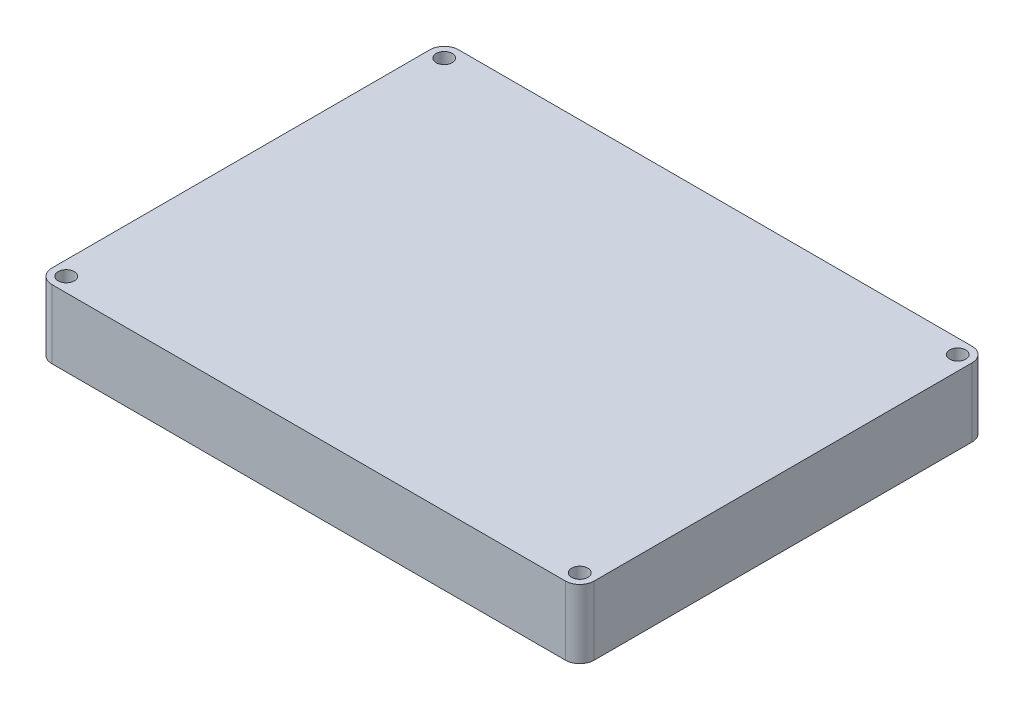
ISO-10303-21;
HEADER;
FILE_DESCRIPTION(('STEP AP214'),'2;1');
FILE_NAME('part.step','',(''),(''),'','','');
FILE_SCHEMA(('AUTOMOTIVE_DESIGN { 1 0 10303 214 1 1 1 1 }'));
ENDSEC;
DATA;
#1=APPLICATION_CONTEXT('core data for automotive mechanical design processes');
#2=APPLICATION_PROTOCOL_DEFINITION('international standard','automotive_design',2000,#1);
#3=PRODUCT_CONTEXT('',#1,'mechanical');
#4=PRODUCT('Part','Part','',(#3));
#5=PRODUCT_RELATED_PRODUCT_CATEGORY('part','',(#4));
#6=PRODUCT_DEFINITION_FORMATION('','',#4);
#7=PRODUCT_DEFINITION_CONTEXT('part definition',#1,'design');
#8=PRODUCT_DEFINITION('design','',#6,#7);
#9=PRODUCT_DEFINITION_SHAPE('','',#8);
#10=(LENGTH_UNIT() NAMED_UNIT(*) SI_UNIT(.MILLI.,.METRE.));
#11=(NAMED_UNIT(*) PLANE_ANGLE_UNIT() SI_UNIT($,.RADIAN.));
#12=(NAMED_UNIT(*) SI_UNIT($,.STERADIAN.) SOLID_ANGLE_UNIT());
#13=UNCERTAINTY_MEASURE_WITH_UNIT(LENGTH_MEASURE(1.E-05),#10,'distance_accuracy_value','');
#14=(GEOMETRIC_REPRESENTATION_CONTEXT(3) GLOBAL_UNCERTAINTY_ASSIGNED_CONTEXT((#13)) GLOBAL_UNIT_ASSIGNED_CONTEXT((#10,
#11,#12)) REPRESENTATION_CONTEXT('',''));
#15=CARTESIAN_POINT('',(0.,0.,0.));
#16=DIRECTION('',(0.,0.,1.));
#17=DIRECTION('',(1.,0.,0.));
#18=AXIS2_PLACEMENT_3D('',#15,#16,#17);
#19=CARTESIAN_POINT('',(80.8445341713162,214.381102149178,252.663824419124));
#20=DIRECTION('',(0.,1.,0.));
#21=DIRECTION('',(1.,0.,0.));
#22=AXIS2_PLACEMENT_3D('',#19,#20,#21);
#23=PLANE('',#22);
#24=CARTESIAN_POINT('',(43.6819406533246,214.381102149178,330.90453928392));
#25=DIRECTION('',(0.,1.,0.));
#26=DIRECTION('',(0.,0.,1.));
#27=AXIS2_PLACEMENT_3D('',#24,#25,#26);
#28=CIRCLE('',#27,1.786001);
#29=CARTESIAN_POINT('',(43.6819406533246,214.381102149178,332.69054028392));
#30=VERTEX_POINT('',#29);
#31=EDGE_CURVE('E189',#30,#30,#28,.T.);
#32=ORIENTED_EDGE('',*,*,#31,.F.);
#33=EDGE_LOOP('',(#32));
#34=FACE_BOUND('',#33,.T.);
#35=CARTESIAN_POINT('',(43.6819406533246,214.381102149178,247.25453928392));
#36=DIRECTION('',(0.,1.,0.));
#37=DIRECTION('',(0.,0.,1.));
#38=AXIS2_PLACEMENT_3D('',#35,#36,#37);
#39=CIRCLE('',#38,1.786001);
#40=CARTESIAN_POINT('',(43.6819406533246,214.381102149178,249.04054028392));
#41=VERTEX_POINT('',#40);
#42=EDGE_CURVE('E183',#41,#41,#39,.T.);
#43=ORIENTED_EDGE('',*,*,#42,.F.);
#44=EDGE_LOOP('',(#43));
#45=FACE_BOUND('',#44,.T.);
#46=CARTESIAN_POINT('',(157.331940653325,214.381102149178,247.25453928392));
#47=DIRECTION('',(0.,1.,0.));
#48=DIRECTION('',(0.,0.,1.));
#49=AXIS2_PLACEMENT_3D('',#46,#47,#48);
#50=CIRCLE('',#49,1.78600100000001);
#51=CARTESIAN_POINT('',(157.331940653325,214.381102149178,249.04054028392));
#52=VERTEX_POINT('',#51);
#53=EDGE_CURVE('E177',#52,#52,#50,.T.);
#54=ORIENTED_EDGE('',*,*,#53,.F.);
#55=EDGE_LOOP('',(#54));
#56=FACE_BOUND('',#55,.T.);
#57=CARTESIAN_POINT('',(157.331940653325,214.381102149178,330.90453928392));
#58=DIRECTION('',(0.,1.,0.));
#59=DIRECTION('',(0.,0.,1.));
#60=AXIS2_PLACEMENT_3D('',#57,#58,#59);
#61=CIRCLE('',#60,1.78600100000001);
#62=CARTESIAN_POINT('',(157.331940653325,214.381102149178,332.69054028392));
#63=VERTEX_POINT('',#62);
#64=EDGE_CURVE('E171',#63,#63,#61,.T.);
#65=ORIENTED_EDGE('',*,*,#64,.F.);
#66=EDGE_LOOP('',(#65));
#67=FACE_BOUND('',#66,.T.);
#68=DIRECTION('',(-1.,0.,0.));
#69=VECTOR('',#68,1.);
#70=CARTESIAN_POINT('',(82.2269406532946,214.381102149178,334.07953928392));
#71=LINE('',#70,#69);
#72=CARTESIAN_POINT('',(157.331940653325,214.381102149178,334.07953928392));
#73=VERTEX_POINT('',#72);
#74=CARTESIAN_POINT('',(43.6819406533246,214.381102149178,334.07953928392));
#75=VERTEX_POINT('',#74);
#76=EDGE_CURVE('E40',#73,#75,#71,.T.);
#77=ORIENTED_EDGE('',*,*,#76,.F.);
#78=CARTESIAN_POINT('',(157.331940653325,214.381102149178,330.90453928392));
#79=DIRECTION('',(0.,1.,0.));
#80=DIRECTION('',(0.,0.,1.));
#81=AXIS2_PLACEMENT_3D('',#78,#79,#80);
#82=CIRCLE('',#81,3.175);
#83=CARTESIAN_POINT('',(160.506940653325,214.381102149178,330.90453928392));
#84=VERTEX_POINT('',#83);
#85=EDGE_CURVE('E127',#84,#73,#82,.F.);
#86=ORIENTED_EDGE('',*,*,#85,.F.);
#87=DIRECTION('',(0.,0.,1.));
#88=VECTOR('',#87,1.);
#89=CARTESIAN_POINT('',(160.506940653325,214.381102149178,301.30953928392));
#90=LINE('',#89,#88);
#91=CARTESIAN_POINT('',(160.506940653325,214.381102149178,247.25453928392));
#92=VERTEX_POINT('',#91);
#93=EDGE_CURVE('E131',#92,#84,#90,.T.);
#94=ORIENTED_EDGE('',*,*,#93,.F.);
#95=CARTESIAN_POINT('',(157.331940653325,214.381102149178,247.25453928392));
#96=DIRECTION('',(0.,1.,0.));
#97=DIRECTION('',(0.,0.,1.));
#98=AXIS2_PLACEMENT_3D('',#95,#96,#97);
#99=CIRCLE('',#98,3.17500000000001);
#100=CARTESIAN_POINT('',(157.331940653325,214.381102149178,244.07953928392));
#101=VERTEX_POINT('',#100);
#102=EDGE_CURVE('E135',#101,#92,#99,.F.);
#103=ORIENTED_EDGE('',*,*,#102,.F.);
#104=DIRECTION('',(1.,0.,0.));
#105=VECTOR('',#104,1.);
#106=CARTESIAN_POINT('',(82.2269406532946,214.381102149178,244.07953928392));
#107=LINE('',#106,#105);
#108=CARTESIAN_POINT('',(43.6819406533246,214.381102149178,244.07953928392));
#109=VERTEX_POINT('',#108);
#110=EDGE_CURVE('E139',#109,#101,#107,.T.);
#111=ORIENTED_EDGE('',*,*,#110,.F.);
#112=CARTESIAN_POINT('',(43.6819406533246,214.381102149178,247.25453928392));
#113=DIRECTION('',(0.,1.,0.));
#114=DIRECTION('',(0.,0.,1.));
#115=AXIS2_PLACEMENT_3D('',#112,#113,#114);
#116=CIRCLE('',#115,3.175);
#117=CARTESIAN_POINT('',(40.5069406533246,214.381102149178,247.25453928392));
#118=VERTEX_POINT('',#117);
#119=EDGE_CURVE('E75',#118,#109,#116,.F.);
#120=ORIENTED_EDGE('',*,*,#119,.F.);
#121=DIRECTION('',(0.,0.,-1.));
#122=VECTOR('',#121,1.);
#123=CARTESIAN_POINT('',(40.5069406533246,214.381102149178,301.30953928392));
#124=LINE('',#123,#122);
#125=CARTESIAN_POINT('',(40.5069406533246,214.381102149178,330.90453928392));
#126=VERTEX_POINT('',#125);
#127=EDGE_CURVE('E80',#126,#118,#124,.T.);
#128=ORIENTED_EDGE('',*,*,#127,.F.);
#129=CARTESIAN_POINT('',(43.6819406533246,214.381102149178,330.90453928392));
#130=DIRECTION('',(0.,1.,0.));
#131=DIRECTION('',(0.,0.,1.));
#132=AXIS2_PLACEMENT_3D('',#129,#130,#131);
#133=CIRCLE('',#132,3.17499999999999);
#134=EDGE_CURVE('E107',#75,#126,#133,.F.);
#135=ORIENTED_EDGE('',*,*,#134,.F.);
#136=EDGE_LOOP('',(#77,#86,#94,#103,#111,#120,#128,#135));
#137=FACE_BOUND('',#136,.T.);
#138=ADVANCED_FACE('F32',(#34,#45,#56,#67,#137),#23,.T.);
#139=CARTESIAN_POINT('',(43.6819406533246,199.201102149175,330.90453928392));
#140=DIRECTION('',(0.,-1.,0.));
#141=DIRECTION('',(0.,0.,-1.));
#142=AXIS2_PLACEMENT_3D('',#139,#140,#141);
#143=PLANE('',#142);
#144=CARTESIAN_POINT('',(43.6819406533246,199.201102149175,330.90453928392));
#145=DIRECTION('',(0.,1.,0.));
#146=DIRECTION('',(0.,0.,1.));
#147=AXIS2_PLACEMENT_3D('',#144,#145,#146);
#148=CIRCLE('',#147,1.786001);
#149=CARTESIAN_POINT('',(43.6819406533246,199.201102149175,332.69054028392));
#150=VERTEX_POINT('',#149);
#151=EDGE_CURVE('E186',#150,#150,#148,.T.);
#152=ORIENTED_EDGE('',*,*,#151,.T.);
#153=EDGE_LOOP('',(#152));
#154=FACE_BOUND('',#153,.T.);
#155=CARTESIAN_POINT('',(43.6819406533246,199.201102149175,247.25453928392));
#156=DIRECTION('',(0.,1.,0.));
#157=DIRECTION('',(0.,0.,1.));
#158=AXIS2_PLACEMENT_3D('',#155,#156,#157);
#159=CIRCLE('',#158,1.786001);
#160=CARTESIAN_POINT('',(43.6819406533246,199.201102149175,249.04054028392));
#161=VERTEX_POINT('',#160);
#162=EDGE_CURVE('E180',#161,#161,#159,.T.);
#163=ORIENTED_EDGE('',*,*,#162,.T.);
#164=EDGE_LOOP('',(#163));
#165=FACE_BOUND('',#164,.T.);
#166=CARTESIAN_POINT('',(157.331940653325,199.201102149175,247.25453928392));
#167=DIRECTION('',(0.,1.,0.));
#168=DIRECTION('',(0.,0.,1.));
#169=AXIS2_PLACEMENT_3D('',#166,#167,#168);
#170=CIRCLE('',#169,1.78600100000001);
#171=CARTESIAN_POINT('',(157.331940653325,199.201102149175,249.04054028392));
#172=VERTEX_POINT('',#171);
#173=EDGE_CURVE('E174',#172,#172,#170,.T.);
#174=ORIENTED_EDGE('',*,*,#173,.T.);
#175=EDGE_LOOP('',(#174));
#176=FACE_BOUND('',#175,.T.);
#177=CARTESIAN_POINT('',(157.331940653325,199.201102149175,330.90453928392));
#178=DIRECTION('',(0.,1.,0.));
#179=DIRECTION('',(0.,0.,1.));
#180=AXIS2_PLACEMENT_3D('',#177,#178,#179);
#181=CIRCLE('',#180,1.78600100000001);
#182=CARTESIAN_POINT('',(157.331940653325,199.201102149175,332.69054028392));
#183=VERTEX_POINT('',#182);
#184=EDGE_CURVE('E119',#183,#183,#181,.T.);
#185=ORIENTED_EDGE('',*,*,#184,.T.);
#186=EDGE_LOOP('',(#185));
#187=FACE_BOUND('',#186,.T.);
#188=DIRECTION('',(-1.,0.,0.));
#189=VECTOR('',#188,1.);
#190=CARTESIAN_POINT('',(82.2269406532946,199.201102149175,334.07953928392));
#191=LINE('',#190,#189);
#192=CARTESIAN_POINT('',(157.331940653325,199.201102149175,334.07953928392));
#193=VERTEX_POINT('',#192);
#194=CARTESIAN_POINT('',(43.6819406533246,199.201102149175,334.07953928392));
#195=VERTEX_POINT('',#194);
#196=EDGE_CURVE('E117',#193,#195,#191,.T.);
#197=ORIENTED_EDGE('',*,*,#196,.T.);
#198=CARTESIAN_POINT('',(43.6819406533246,199.201102149175,330.90453928392));
#199=DIRECTION('',(0.,-1.,0.));
#200=DIRECTION('',(0.,0.,-1.));
#201=AXIS2_PLACEMENT_3D('',#198,#199,#200);
#202=CIRCLE('',#201,3.17499999999999);
#203=CARTESIAN_POINT('',(40.5069406533246,199.201102149175,330.90453928392));
#204=VERTEX_POINT('',#203);
#205=EDGE_CURVE('E105',#195,#204,#202,.T.);
#206=ORIENTED_EDGE('',*,*,#205,.T.);
#207=DIRECTION('',(0.,0.,-1.));
#208=VECTOR('',#207,1.);
#209=CARTESIAN_POINT('',(40.5069406533246,199.201102149175,301.30953928392));
#210=LINE('',#209,#208);
#211=CARTESIAN_POINT('',(40.5069406533246,199.201102149175,247.25453928392));
#212=VERTEX_POINT('',#211);
#213=EDGE_CURVE('E109',#204,#212,#210,.T.);
#214=ORIENTED_EDGE('',*,*,#213,.T.);
#215=CARTESIAN_POINT('',(43.6819406533246,199.201102149175,247.25453928392));
#216=DIRECTION('',(0.,-1.,0.));
#217=DIRECTION('',(0.,0.,-1.));
#218=AXIS2_PLACEMENT_3D('',#215,#216,#217);
#219=CIRCLE('',#218,3.175);
#220=CARTESIAN_POINT('',(43.6819406533246,199.201102149175,244.07953928392));
#221=VERTEX_POINT('',#220);
#222=EDGE_CURVE('E113',#212,#221,#219,.T.);
#223=ORIENTED_EDGE('',*,*,#222,.T.);
#224=DIRECTION('',(1.,0.,0.));
#225=VECTOR('',#224,1.);
#226=CARTESIAN_POINT('',(82.2269406532946,199.201102149175,244.07953928392));
#227=LINE('',#226,#225);
#228=CARTESIAN_POINT('',(157.331940653325,199.201102149175,244.07953928392));
#229=VERTEX_POINT('',#228);
#230=EDGE_CURVE('E156',#221,#229,#227,.T.);
#231=ORIENTED_EDGE('',*,*,#230,.T.);
#232=CARTESIAN_POINT('',(157.331940653325,199.201102149175,247.25453928392));
#233=DIRECTION('',(0.,-1.,0.));
#234=DIRECTION('',(0.,0.,-1.));
#235=AXIS2_PLACEMENT_3D('',#232,#233,#234);
#236=CIRCLE('',#235,3.17500000000001);
#237=CARTESIAN_POINT('',(160.506940653325,199.201102149175,247.25453928392));
#238=VERTEX_POINT('',#237);
#239=EDGE_CURVE('E161',#229,#238,#236,.T.);
#240=ORIENTED_EDGE('',*,*,#239,.T.);
#241=DIRECTION('',(0.,0.,1.));
#242=VECTOR('',#241,1.);
#243=CARTESIAN_POINT('',(160.506940653325,199.201102149175,301.30953928392));
#244=LINE('',#243,#242);
#245=CARTESIAN_POINT('',(160.506940653325,199.201102149175,330.90453928392));
#246=VERTEX_POINT('',#245);
#247=EDGE_CURVE('E165',#238,#246,#244,.T.);
#248=ORIENTED_EDGE('',*,*,#247,.T.);
#249=CARTESIAN_POINT('',(157.331940653325,199.201102149175,330.90453928392));
#250=DIRECTION('',(0.,-1.,0.));
#251=DIRECTION('',(0.,0.,-1.));
#252=AXIS2_PLACEMENT_3D('',#249,#250,#251);
#253=CIRCLE('',#252,3.175);
#254=EDGE_CURVE('E124',#246,#193,#253,.T.);
#255=ORIENTED_EDGE('',*,*,#254,.T.);
#256=EDGE_LOOP('',(#197,#206,#214,#223,#231,#240,#248,#255));
#257=FACE_BOUND('',#256,.T.);
#258=ADVANCED_FACE('F115',(#154,#165,#176,#187,#257),#143,.T.);
#259=CARTESIAN_POINT('',(43.6819406533246,364.381102149178,330.90453928392));
#260=DIRECTION('',(0.,-1.,0.));
#261=DIRECTION('',(0.,0.,-1.));
#262=AXIS2_PLACEMENT_3D('',#259,#260,#261);
#263=CYLINDRICAL_SURFACE('',#262,3.17499999999999);
#264=DIRECTION('',(0.,-1.,0.));
#265=VECTOR('',#264,1.);
#266=CARTESIAN_POINT('',(43.6819406533246,364.381102149178,334.07953928392));
#267=LINE('',#266,#265);
#268=EDGE_CURVE('E11',#75,#195,#267,.T.);
#269=ORIENTED_EDGE('',*,*,#268,.F.);
#270=ORIENTED_EDGE('',*,*,#134,.T.);
#271=DIRECTION('',(0.,-1.,0.));
#272=VECTOR('',#271,1.);
#273=CARTESIAN_POINT('',(40.5069406533246,364.381102149178,330.90453928392));
#274=LINE('',#273,#272);
#275=EDGE_CURVE('E102',#126,#204,#274,.T.);
#276=ORIENTED_EDGE('',*,*,#275,.T.);
#277=ORIENTED_EDGE('',*,*,#205,.F.);
#278=EDGE_LOOP('',(#269,#270,#276,#277));
#279=FACE_BOUND('',#278,.T.);
#280=ADVANCED_FACE('F103',(#279),#263,.T.);
#281=CARTESIAN_POINT('',(40.5069406533246,364.381102149178,301.30953928392));
#282=DIRECTION('',(-1.,0.,0.));
#283=DIRECTION('',(0.,0.,1.));
#284=AXIS2_PLACEMENT_3D('',#281,#282,#283);
#285=PLANE('',#284);
#286=ORIENTED_EDGE('',*,*,#275,.F.);
#287=ORIENTED_EDGE('',*,*,#127,.T.);
#288=DIRECTION('',(0.,-1.,0.));
#289=VECTOR('',#288,1.);
#290=CARTESIAN_POINT('',(40.5069406533246,364.381102149178,247.25453928392));
#291=LINE('',#290,#289);
#292=EDGE_CURVE('E97',#118,#212,#291,.T.);
#293=ORIENTED_EDGE('',*,*,#292,.T.);
#294=ORIENTED_EDGE('',*,*,#213,.F.);
#295=EDGE_LOOP('',(#286,#287,#293,#294));
#296=FACE_BOUND('',#295,.T.);
#297=ADVANCED_FACE('F110',(#296),#285,.T.);
#298=CARTESIAN_POINT('',(43.6819406533246,364.381102149178,247.25453928392));
#299=DIRECTION('',(0.,-1.,0.));
#300=DIRECTION('',(0.,0.,-1.));
#301=AXIS2_PLACEMENT_3D('',#298,#299,#300);
#302=CYLINDRICAL_SURFACE('',#301,3.175);
#303=ORIENTED_EDGE('',*,*,#292,.F.);
#304=ORIENTED_EDGE('',*,*,#119,.T.);
#305=DIRECTION('',(0.,-1.,0.));
#306=VECTOR('',#305,1.);
#307=CARTESIAN_POINT('',(43.6819406533246,364.381102149178,244.07953928392));
#308=LINE('',#307,#306);
#309=EDGE_CURVE('E142',#109,#221,#308,.T.);
#310=ORIENTED_EDGE('',*,*,#309,.T.);
#311=ORIENTED_EDGE('',*,*,#222,.F.);
#312=EDGE_LOOP('',(#303,#304,#310,#311));
#313=FACE_BOUND('',#312,.T.);
#314=ADVANCED_FACE('F153',(#313),#302,.T.);
#315=CARTESIAN_POINT('',(82.2269406532946,364.381102149178,244.07953928392));
#316=DIRECTION('',(0.,0.,-1.));
#317=DIRECTION('',(-1.,0.,0.));
#318=AXIS2_PLACEMENT_3D('',#315,#316,#317);
#319=PLANE('',#318);
#320=ORIENTED_EDGE('',*,*,#309,.F.);
#321=ORIENTED_EDGE('',*,*,#110,.T.);
#322=DIRECTION('',(0.,-1.,0.));
#323=VECTOR('',#322,1.);
#324=CARTESIAN_POINT('',(157.331940653325,364.381102149178,244.07953928392));
#325=LINE('',#324,#323);
#326=EDGE_CURVE('E138',#101,#229,#325,.T.);
#327=ORIENTED_EDGE('',*,*,#326,.T.);
#328=ORIENTED_EDGE('',*,*,#230,.F.);
#329=EDGE_LOOP('',(#320,#321,#327,#328));
#330=FACE_BOUND('',#329,.T.);
#331=ADVANCED_FACE('F157',(#330),#319,.T.);
#332=CARTESIAN_POINT('',(157.331940653325,364.381102149178,247.25453928392));
#333=DIRECTION('',(0.,-1.,0.));
#334=DIRECTION('',(0.,0.,-1.));
#335=AXIS2_PLACEMENT_3D('',#332,#333,#334);
#336=CYLINDRICAL_SURFACE('',#335,3.17500000000001);
#337=ORIENTED_EDGE('',*,*,#326,.F.);
#338=ORIENTED_EDGE('',*,*,#102,.T.);
#339=DIRECTION('',(0.,-1.,0.));
#340=VECTOR('',#339,1.);
#341=CARTESIAN_POINT('',(160.506940653325,364.381102149178,247.25453928392));
#342=LINE('',#341,#340);
#343=EDGE_CURVE('E134',#92,#238,#342,.T.);
#344=ORIENTED_EDGE('',*,*,#343,.T.);
#345=ORIENTED_EDGE('',*,*,#239,.F.);
#346=EDGE_LOOP('',(#337,#338,#344,#345));
#347=FACE_BOUND('',#346,.T.);
#348=ADVANCED_FACE('F213',(#347),#336,.T.);
#349=CARTESIAN_POINT('',(160.506940653325,364.381102149178,301.30953928392));
#350=DIRECTION('',(1.,0.,0.));
#351=DIRECTION('',(0.,0.,-1.));
#352=AXIS2_PLACEMENT_3D('',#349,#350,#351);
#353=PLANE('',#352);
#354=ORIENTED_EDGE('',*,*,#343,.F.);
#355=ORIENTED_EDGE('',*,*,#93,.T.);
#356=DIRECTION('',(0.,-1.,0.));
#357=VECTOR('',#356,1.);
#358=CARTESIAN_POINT('',(160.506940653325,364.381102149178,330.90453928392));
#359=LINE('',#358,#357);
#360=EDGE_CURVE('E130',#84,#246,#359,.T.);
#361=ORIENTED_EDGE('',*,*,#360,.T.);
#362=ORIENTED_EDGE('',*,*,#247,.F.);
#363=EDGE_LOOP('',(#354,#355,#361,#362));
#364=FACE_BOUND('',#363,.T.);
#365=ADVANCED_FACE('F211',(#364),#353,.T.);
#366=CARTESIAN_POINT('',(157.331940653325,364.381102149178,330.90453928392));
#367=DIRECTION('',(0.,-1.,0.));
#368=DIRECTION('',(0.,0.,-1.));
#369=AXIS2_PLACEMENT_3D('',#366,#367,#368);
#370=CYLINDRICAL_SURFACE('',#369,3.175);
#371=ORIENTED_EDGE('',*,*,#360,.F.);
#372=ORIENTED_EDGE('',*,*,#85,.T.);
#373=DIRECTION('',(0.,-1.,0.));
#374=VECTOR('',#373,1.);
#375=CARTESIAN_POINT('',(157.331940653325,364.381102149178,334.07953928392));
#376=LINE('',#375,#374);
#377=EDGE_CURVE('E126',#73,#193,#376,.T.);
#378=ORIENTED_EDGE('',*,*,#377,.T.);
#379=ORIENTED_EDGE('',*,*,#254,.F.);
#380=EDGE_LOOP('',(#371,#372,#378,#379));
#381=FACE_BOUND('',#380,.T.);
#382=ADVANCED_FACE('F207',(#381),#370,.T.);
#383=CARTESIAN_POINT('',(82.2269406532946,364.381102149178,334.07953928392));
#384=DIRECTION('',(0.,0.,1.));
#385=DIRECTION('',(1.,0.,0.));
#386=AXIS2_PLACEMENT_3D('',#383,#384,#385);
#387=PLANE('',#386);
#388=ORIENTED_EDGE('',*,*,#377,.F.);
#389=ORIENTED_EDGE('',*,*,#76,.T.);
#390=ORIENTED_EDGE('',*,*,#268,.T.);
#391=ORIENTED_EDGE('',*,*,#196,.F.);
#392=EDGE_LOOP('',(#388,#389,#390,#391));
#393=FACE_BOUND('',#392,.T.);
#394=ADVANCED_FACE('F204',(#393),#387,.T.);
#395=CARTESIAN_POINT('',(157.331940653325,214.381102149178,330.90453928392));
#396=DIRECTION('',(0.,1.,0.));
#397=DIRECTION('',(0.,0.,1.));
#398=AXIS2_PLACEMENT_3D('',#395,#396,#397);
#399=CYLINDRICAL_SURFACE('',#398,1.78600100000001);
#400=ORIENTED_EDGE('',*,*,#184,.F.);
#401=EDGE_LOOP('',(#400));
#402=FACE_BOUND('',#401,.T.);
#403=ORIENTED_EDGE('',*,*,#64,.T.);
#404=EDGE_LOOP('',(#403));
#405=FACE_BOUND('',#404,.T.);
#406=ADVANCED_FACE('F238',(#402,#405),#399,.F.);
#407=CARTESIAN_POINT('',(157.331940653325,214.381102149178,247.25453928392));
#408=DIRECTION('',(0.,1.,0.));
#409=DIRECTION('',(0.,0.,1.));
#410=AXIS2_PLACEMENT_3D('',#407,#408,#409);
#411=CYLINDRICAL_SURFACE('',#410,1.78600100000001);
#412=ORIENTED_EDGE('',*,*,#173,.F.);
#413=EDGE_LOOP('',(#412));
#414=FACE_BOUND('',#413,.T.);
#415=ORIENTED_EDGE('',*,*,#53,.T.);
#416=EDGE_LOOP('',(#415));
#417=FACE_BOUND('',#416,.T.);
#418=ADVANCED_FACE('F257',(#414,#417),#411,.F.);
#419=CARTESIAN_POINT('',(43.6819406533246,214.381102149178,247.25453928392));
#420=DIRECTION('',(0.,1.,0.));
#421=DIRECTION('',(0.,0.,1.));
#422=AXIS2_PLACEMENT_3D('',#419,#420,#421);
#423=CYLINDRICAL_SURFACE('',#422,1.786001);
#424=ORIENTED_EDGE('',*,*,#162,.F.);
#425=EDGE_LOOP('',(#424));
#426=FACE_BOUND('',#425,.T.);
#427=ORIENTED_EDGE('',*,*,#42,.T.);
#428=EDGE_LOOP('',(#427));
#429=FACE_BOUND('',#428,.T.);
#430=ADVANCED_FACE('F264',(#426,#429),#423,.F.);
#431=CARTESIAN_POINT('',(43.6819406533246,214.381102149178,330.90453928392));
#432=DIRECTION('',(0.,1.,0.));
#433=DIRECTION('',(0.,0.,1.));
#434=AXIS2_PLACEMENT_3D('',#431,#432,#433);
#435=CYLINDRICAL_SURFACE('',#434,1.786001);
#436=ORIENTED_EDGE('',*,*,#151,.F.);
#437=EDGE_LOOP('',(#436));
#438=FACE_BOUND('',#437,.T.);
#439=ORIENTED_EDGE('',*,*,#31,.T.);
#440=EDGE_LOOP('',(#439));
#441=FACE_BOUND('',#440,.T.);
#442=ADVANCED_FACE('F193',(#438,#441),#435,.F.);
#443=CLOSED_SHELL('',(#138,#258,#280,#297,#314,#331,#348,#365,#382,#394,#406,#418,#430,#442));
#444=MANIFOLD_SOLID_BREP('B2',#443);
#445=ADVANCED_BREP_SHAPE_REPRESENTATION('',(#18,#444),#14);
#446=SHAPE_DEFINITION_REPRESENTATION(#9,#445);
ENDSEC;
END-ISO-10303-21;
